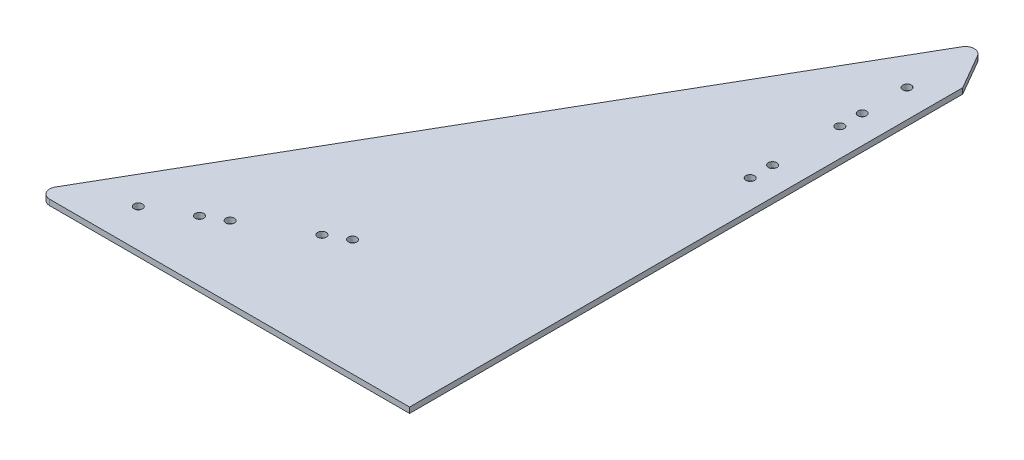
ISO-10303-21;
HEADER;
FILE_DESCRIPTION(('STEP AP214'),'2;1');
FILE_NAME('part.step','',(''),(''),'','','');
FILE_SCHEMA(('AUTOMOTIVE_DESIGN { 1 0 10303 214 1 1 1 1 }'));
ENDSEC;
DATA;
#1=APPLICATION_CONTEXT('core data for automotive mechanical design processes');
#2=APPLICATION_PROTOCOL_DEFINITION('international standard','automotive_design',2000,#1);
#3=PRODUCT_CONTEXT('',#1,'mechanical');
#4=PRODUCT('Part','Part','',(#3));
#5=PRODUCT_RELATED_PRODUCT_CATEGORY('part','',(#4));
#6=PRODUCT_DEFINITION_FORMATION('','',#4);
#7=PRODUCT_DEFINITION_CONTEXT('part definition',#1,'design');
#8=PRODUCT_DEFINITION('design','',#6,#7);
#9=PRODUCT_DEFINITION_SHAPE('','',#8);
#10=(LENGTH_UNIT() NAMED_UNIT(*) SI_UNIT(.MILLI.,.METRE.));
#11=(NAMED_UNIT(*) PLANE_ANGLE_UNIT() SI_UNIT($,.RADIAN.));
#12=(NAMED_UNIT(*) SI_UNIT($,.STERADIAN.) SOLID_ANGLE_UNIT());
#13=UNCERTAINTY_MEASURE_WITH_UNIT(LENGTH_MEASURE(1.E-05),#10,'distance_accuracy_value','');
#14=(GEOMETRIC_REPRESENTATION_CONTEXT(3) GLOBAL_UNCERTAINTY_ASSIGNED_CONTEXT((#13)) GLOBAL_UNIT_ASSIGNED_CONTEXT((#10,
#11,#12)) REPRESENTATION_CONTEXT('',''));
#15=CARTESIAN_POINT('',(0.,0.,0.));
#16=DIRECTION('',(0.,0.,1.));
#17=DIRECTION('',(1.,0.,0.));
#18=AXIS2_PLACEMENT_3D('',#15,#16,#17);
#19=CARTESIAN_POINT('',(196.85,3.175,-340.954201469933));
#20=DIRECTION('',(0.866025403784439,0.,0.5));
#21=DIRECTION('',(0.5,0.,-0.866025403784439));
#22=AXIS2_PLACEMENT_3D('',#19,#20,#21);
#23=PLANE('',#22);
#24=DIRECTION('',(-0.5,0.,0.866025403784439));
#25=VECTOR('',#24,1.);
#26=CARTESIAN_POINT('',(196.85,3.175,-340.954201469933));
#27=LINE('',#26,#25);
#28=CARTESIAN_POINT('',(192.450590948775,3.175,-333.334201469933));
#29=VERTEX_POINT('',#28);
#30=CARTESIAN_POINT('',(4.39940905122493,3.175,-7.61999999999996));
#31=VERTEX_POINT('',#30);
#32=EDGE_CURVE('E109',#29,#31,#27,.T.);
#33=ORIENTED_EDGE('',*,*,#32,.F.);
#34=DIRECTION('',(0.,-1.,0.));
#35=VECTOR('',#34,1.);
#36=CARTESIAN_POINT('',(192.450590948775,3.175,-333.334201469933));
#37=LINE('',#36,#35);
#38=CARTESIAN_POINT('',(192.450590948775,0.,-333.334201469933));
#39=VERTEX_POINT('',#38);
#40=EDGE_CURVE('E120',#29,#39,#37,.T.);
#41=ORIENTED_EDGE('',*,*,#40,.T.);
#42=DIRECTION('',(-0.5,0.,0.866025403784439));
#43=VECTOR('',#42,1.);
#44=CARTESIAN_POINT('',(196.85,0.,-340.954201469933));
#45=LINE('',#44,#43);
#46=CARTESIAN_POINT('',(4.39940905122493,0.,-7.61999999999996));
#47=VERTEX_POINT('',#46);
#48=EDGE_CURVE('E114',#39,#47,#45,.T.);
#49=ORIENTED_EDGE('',*,*,#48,.T.);
#50=DIRECTION('',(0.,-1.,0.));
#51=VECTOR('',#50,1.);
#52=CARTESIAN_POINT('',(4.39940905122499,3.175,-7.62000000000002));
#53=LINE('',#52,#51);
#54=EDGE_CURVE('E118',#47,#31,#53,.F.);
#55=ORIENTED_EDGE('',*,*,#54,.T.);
#56=EDGE_LOOP('',(#33,#41,#49,#55));
#57=FACE_BOUND('',#56,.T.);
#58=ADVANCED_FACE('F33',(#57),#23,.F.);
#59=CARTESIAN_POINT('',(0.,3.175,0.));
#60=DIRECTION('',(0.,0.,-1.));
#61=DIRECTION('',(-1.,0.,0.));
#62=AXIS2_PLACEMENT_3D('',#59,#60,#61);
#63=PLANE('',#62);
#64=DIRECTION('',(1.,0.,0.));
#65=VECTOR('',#64,1.);
#66=CARTESIAN_POINT('',(0.,0.,0.));
#67=LINE('',#66,#65);
#68=CARTESIAN_POINT('',(8.79881810244991,0.,0.));
#69=VERTEX_POINT('',#68);
#70=CARTESIAN_POINT('',(212.725,0.,0.));
#71=VERTEX_POINT('',#70);
#72=EDGE_CURVE('E110',#69,#71,#67,.T.);
#73=ORIENTED_EDGE('',*,*,#72,.T.);
#74=DIRECTION('',(0.,1.,0.));
#75=VECTOR('',#74,1.);
#76=CARTESIAN_POINT('',(212.725,-360.104992878323,0.));
#77=LINE('',#76,#75);
#78=CARTESIAN_POINT('',(212.725,3.175,0.));
#79=VERTEX_POINT('',#78);
#80=EDGE_CURVE('E48',#71,#79,#77,.T.);
#81=ORIENTED_EDGE('',*,*,#80,.T.);
#82=DIRECTION('',(1.,0.,0.));
#83=VECTOR('',#82,1.);
#84=CARTESIAN_POINT('',(0.,3.175,0.));
#85=LINE('',#84,#83);
#86=CARTESIAN_POINT('',(8.79881810244991,3.175,0.));
#87=VERTEX_POINT('',#86);
#88=EDGE_CURVE('E112',#87,#79,#85,.T.);
#89=ORIENTED_EDGE('',*,*,#88,.F.);
#90=DIRECTION('',(0.,-1.,0.));
#91=VECTOR('',#90,1.);
#92=CARTESIAN_POINT('',(8.79881810244991,3.175,0.));
#93=LINE('',#92,#91);
#94=EDGE_CURVE('E11',#87,#69,#93,.T.);
#95=ORIENTED_EDGE('',*,*,#94,.T.);
#96=EDGE_LOOP('',(#73,#81,#89,#95));
#97=FACE_BOUND('',#96,.T.);
#98=ADVANCED_FACE('F150',(#97),#63,.F.);
#99=CARTESIAN_POINT('',(393.7,3.175,0.));
#100=DIRECTION('',(-0.866025403784439,0.,0.5));
#101=DIRECTION('',(0.5,0.,0.866025403784439));
#102=AXIS2_PLACEMENT_3D('',#99,#100,#101);
#103=PLANE('',#102);
#104=DIRECTION('',(-0.5,0.,-0.866025403784439));
#105=VECTOR('',#104,1.);
#106=CARTESIAN_POINT('',(393.7,3.175,0.));
#107=LINE('',#106,#105);
#108=CARTESIAN_POINT('',(212.725,3.175,-313.457894899778));
#109=VERTEX_POINT('',#108);
#110=CARTESIAN_POINT('',(201.249409051225,3.175,-333.334201469934));
#111=VERTEX_POINT('',#110);
#112=EDGE_CURVE('E103',#109,#111,#107,.T.);
#113=ORIENTED_EDGE('',*,*,#112,.F.);
#114=DIRECTION('',(0.,1.,0.));
#115=VECTOR('',#114,1.);
#116=CARTESIAN_POINT('',(212.725,-360.104992878323,-313.457894899778));
#117=LINE('',#116,#115);
#118=CARTESIAN_POINT('',(212.725,0.,-313.457894899778));
#119=VERTEX_POINT('',#118);
#120=EDGE_CURVE('E88',#119,#109,#117,.T.);
#121=ORIENTED_EDGE('',*,*,#120,.F.);
#122=DIRECTION('',(-0.5,0.,-0.866025403784439));
#123=VECTOR('',#122,1.);
#124=CARTESIAN_POINT('',(393.7,0.,0.));
#125=LINE('',#124,#123);
#126=CARTESIAN_POINT('',(201.249409051225,0.,-333.334201469934));
#127=VERTEX_POINT('',#126);
#128=EDGE_CURVE('E101',#119,#127,#125,.T.);
#129=ORIENTED_EDGE('',*,*,#128,.T.);
#130=DIRECTION('',(0.,-1.,0.));
#131=VECTOR('',#130,1.);
#132=CARTESIAN_POINT('',(201.249409051225,3.175,-333.334201469933));
#133=LINE('',#132,#131);
#134=EDGE_CURVE('E126',#127,#111,#133,.F.);
#135=ORIENTED_EDGE('',*,*,#134,.T.);
#136=EDGE_LOOP('',(#113,#121,#129,#135));
#137=FACE_BOUND('',#136,.T.);
#138=ADVANCED_FACE('F99',(#137),#103,.F.);
#139=CARTESIAN_POINT('',(0.,3.175,0.));
#140=DIRECTION('',(0.,1.,0.));
#141=DIRECTION('',(0.,0.,1.));
#142=AXIS2_PLACEMENT_3D('',#139,#140,#141);
#143=PLANE('',#142);
#144=DIRECTION('',(0.,0.,1.));
#145=VECTOR('',#144,1.);
#146=CARTESIAN_POINT('',(212.725,3.175,0.));
#147=LINE('',#146,#145);
#148=EDGE_CURVE('E95',#109,#79,#147,.T.);
#149=ORIENTED_EDGE('',*,*,#148,.F.);
#150=ORIENTED_EDGE('',*,*,#112,.T.);
#151=CARTESIAN_POINT('',(196.85,3.175,-330.794201469934));
#152=DIRECTION('',(0.,1.,0.));
#153=DIRECTION('',(0.,0.,1.));
#154=AXIS2_PLACEMENT_3D('',#151,#152,#153);
#155=CIRCLE('',#154,5.08);
#156=EDGE_CURVE('E41',#111,#29,#155,.T.);
#157=ORIENTED_EDGE('',*,*,#156,.T.);
#158=ORIENTED_EDGE('',*,*,#32,.T.);
#159=CARTESIAN_POINT('',(8.79881810244991,3.175,-5.08));
#160=DIRECTION('',(0.,1.,0.));
#161=DIRECTION('',(0.,0.,1.));
#162=AXIS2_PLACEMENT_3D('',#159,#160,#161);
#163=CIRCLE('',#162,5.08);
#164=EDGE_CURVE('E56',#31,#87,#163,.T.);
#165=ORIENTED_EDGE('',*,*,#164,.T.);
#166=ORIENTED_EDGE('',*,*,#88,.T.);
#167=EDGE_LOOP('',(#149,#150,#157,#158,#165,#166));
#168=FACE_BOUND('',#167,.T.);
#169=CARTESIAN_POINT('',(37.3949769354121,3.175,-21.59));
#170=DIRECTION('',(0.,1.,0.));
#171=DIRECTION('',(0.,0.,1.));
#172=AXIS2_PLACEMENT_3D('',#169,#170,#171);
#173=CIRCLE('',#172,2.413);
#174=CARTESIAN_POINT('',(37.3949769354121,3.175,-19.177));
#175=VERTEX_POINT('',#174);
#176=EDGE_CURVE('E310',#175,#175,#173,.T.);
#177=ORIENTED_EDGE('',*,*,#176,.F.);
#178=EDGE_LOOP('',(#177));
#179=FACE_BOUND('',#178,.T.);
#180=CARTESIAN_POINT('',(196.85,3.175,-208.874201469934));
#181=DIRECTION('',(0.,1.,0.));
#182=DIRECTION('',(0.,0.,1.));
#183=AXIS2_PLACEMENT_3D('',#180,#181,#182);
#184=CIRCLE('',#183,2.413);
#185=CARTESIAN_POINT('',(196.85,3.175,-206.461201469934));
#186=VERTEX_POINT('',#185);
#187=EDGE_CURVE('E94',#186,#186,#184,.T.);
#188=ORIENTED_EDGE('',*,*,#187,.F.);
#189=EDGE_LOOP('',(#188));
#190=FACE_BOUND('',#189,.T.);
#191=CARTESIAN_POINT('',(196.85,3.175,-221.574201469934));
#192=DIRECTION('',(0.,1.,0.));
#193=DIRECTION('',(0.,0.,1.));
#194=AXIS2_PLACEMENT_3D('',#191,#192,#193);
#195=CIRCLE('',#194,2.413);
#196=CARTESIAN_POINT('',(196.85,3.175,-219.161201469934));
#197=VERTEX_POINT('',#196);
#198=EDGE_CURVE('E324',#197,#197,#195,.T.);
#199=ORIENTED_EDGE('',*,*,#198,.F.);
#200=EDGE_LOOP('',(#199));
#201=FACE_BOUND('',#200,.T.);
#202=CARTESIAN_POINT('',(196.85,3.175,-259.674201469934));
#203=DIRECTION('',(0.,1.,0.));
#204=DIRECTION('',(0.,0.,1.));
#205=AXIS2_PLACEMENT_3D('',#202,#203,#204);
#206=CIRCLE('',#205,2.413);
#207=CARTESIAN_POINT('',(196.85,3.175,-257.261201469934));
#208=VERTEX_POINT('',#207);
#209=EDGE_CURVE('E358',#208,#208,#206,.T.);
#210=ORIENTED_EDGE('',*,*,#209,.F.);
#211=EDGE_LOOP('',(#210));
#212=FACE_BOUND('',#211,.T.);
#213=CARTESIAN_POINT('',(196.85,3.175,-272.374201469934));
#214=DIRECTION('',(0.,1.,0.));
#215=DIRECTION('',(0.,0.,1.));
#216=AXIS2_PLACEMENT_3D('',#213,#214,#215);
#217=CIRCLE('',#216,2.413);
#218=CARTESIAN_POINT('',(196.85,3.175,-269.961201469934));
#219=VERTEX_POINT('',#218);
#220=EDGE_CURVE('E352',#219,#219,#217,.T.);
#221=ORIENTED_EDGE('',*,*,#220,.F.);
#222=EDGE_LOOP('',(#221));
#223=FACE_BOUND('',#222,.T.);
#224=CARTESIAN_POINT('',(196.85,3.175,-297.774201469934));
#225=DIRECTION('',(0.,1.,0.));
#226=DIRECTION('',(0.,0.,1.));
#227=AXIS2_PLACEMENT_3D('',#224,#225,#226);
#228=CIRCLE('',#227,2.413);
#229=CARTESIAN_POINT('',(196.85,3.175,-295.361201469934));
#230=VERTEX_POINT('',#229);
#231=EDGE_CURVE('E346',#230,#230,#228,.T.);
#232=ORIENTED_EDGE('',*,*,#231,.F.);
#233=EDGE_LOOP('',(#232));
#234=FACE_BOUND('',#233,.T.);
#235=CARTESIAN_POINT('',(103.386112703786,3.175,-59.69));
#236=DIRECTION('',(0.,1.,0.));
#237=DIRECTION('',(0.,0.,1.));
#238=AXIS2_PLACEMENT_3D('',#235,#236,#237);
#239=CIRCLE('',#238,2.41299999999999);
#240=CARTESIAN_POINT('',(103.386112703786,3.175,-57.277));
#241=VERTEX_POINT('',#240);
#242=EDGE_CURVE('E340',#241,#241,#239,.T.);
#243=ORIENTED_EDGE('',*,*,#242,.F.);
#244=EDGE_LOOP('',(#243));
#245=FACE_BOUND('',#244,.T.);
#246=CARTESIAN_POINT('',(114.384635331849,3.175,-66.04));
#247=DIRECTION('',(0.,1.,0.));
#248=DIRECTION('',(0.,0.,1.));
#249=AXIS2_PLACEMENT_3D('',#246,#247,#248);
#250=CIRCLE('',#249,2.41299999999999);
#251=CARTESIAN_POINT('',(114.384635331849,3.175,-63.627));
#252=VERTEX_POINT('',#251);
#253=EDGE_CURVE('E334',#252,#252,#250,.T.);
#254=ORIENTED_EDGE('',*,*,#253,.F.);
#255=EDGE_LOOP('',(#254));
#256=FACE_BOUND('',#255,.T.);
#257=CARTESIAN_POINT('',(70.3905448195992,3.175,-40.64));
#258=DIRECTION('',(0.,1.,0.));
#259=DIRECTION('',(0.,0.,1.));
#260=AXIS2_PLACEMENT_3D('',#257,#258,#259);
#261=CIRCLE('',#260,2.41299999999999);
#262=CARTESIAN_POINT('',(70.3905448195992,3.175,-38.227));
#263=VERTEX_POINT('',#262);
#264=EDGE_CURVE('E328',#263,#263,#261,.T.);
#265=ORIENTED_EDGE('',*,*,#264,.F.);
#266=EDGE_LOOP('',(#265));
#267=FACE_BOUND('',#266,.T.);
#268=CARTESIAN_POINT('',(59.3920221915368,3.175,-34.29));
#269=DIRECTION('',(0.,1.,0.));
#270=DIRECTION('',(0.,0.,1.));
#271=AXIS2_PLACEMENT_3D('',#268,#269,#270);
#272=CIRCLE('',#271,2.41299999999999);
#273=CARTESIAN_POINT('',(59.3920221915368,3.175,-31.877));
#274=VERTEX_POINT('',#273);
#275=EDGE_CURVE('E315',#274,#274,#272,.T.);
#276=ORIENTED_EDGE('',*,*,#275,.F.);
#277=EDGE_LOOP('',(#276));
#278=FACE_BOUND('',#277,.T.);
#279=ADVANCED_FACE('F130',(#168,#179,#190,#201,#212,#223,#234,#245,#256,#267,#278),#143,.T.);
#280=CARTESIAN_POINT('',(0.,0.,0.));
#281=DIRECTION('',(0.,1.,0.));
#282=DIRECTION('',(0.,0.,1.));
#283=AXIS2_PLACEMENT_3D('',#280,#281,#282);
#284=PLANE('',#283);
#285=CARTESIAN_POINT('',(37.3949769354121,0.,-21.59));
#286=DIRECTION('',(0.,1.,0.));
#287=DIRECTION('',(0.,0.,1.));
#288=AXIS2_PLACEMENT_3D('',#285,#286,#287);
#289=CIRCLE('',#288,2.413);
#290=CARTESIAN_POINT('',(37.3949769354121,0.,-19.177));
#291=VERTEX_POINT('',#290);
#292=EDGE_CURVE('E307',#291,#291,#289,.F.);
#293=ORIENTED_EDGE('',*,*,#292,.F.);
#294=EDGE_LOOP('',(#293));
#295=FACE_BOUND('',#294,.T.);
#296=CARTESIAN_POINT('',(196.85,0.,-208.874201469934));
#297=DIRECTION('',(0.,1.,0.));
#298=DIRECTION('',(0.,0.,1.));
#299=AXIS2_PLACEMENT_3D('',#296,#297,#298);
#300=CIRCLE('',#299,2.413);
#301=CARTESIAN_POINT('',(196.85,0.,-206.461201469934));
#302=VERTEX_POINT('',#301);
#303=EDGE_CURVE('E321',#302,#302,#300,.F.);
#304=ORIENTED_EDGE('',*,*,#303,.F.);
#305=EDGE_LOOP('',(#304));
#306=FACE_BOUND('',#305,.T.);
#307=CARTESIAN_POINT('',(196.85,0.,-221.574201469934));
#308=DIRECTION('',(0.,1.,0.));
#309=DIRECTION('',(0.,0.,1.));
#310=AXIS2_PLACEMENT_3D('',#307,#308,#309);
#311=CIRCLE('',#310,2.413);
#312=CARTESIAN_POINT('',(196.85,0.,-219.161201469934));
#313=VERTEX_POINT('',#312);
#314=EDGE_CURVE('E361',#313,#313,#311,.F.);
#315=ORIENTED_EDGE('',*,*,#314,.F.);
#316=EDGE_LOOP('',(#315));
#317=FACE_BOUND('',#316,.T.);
#318=CARTESIAN_POINT('',(196.85,0.,-259.674201469934));
#319=DIRECTION('',(0.,1.,0.));
#320=DIRECTION('',(0.,0.,1.));
#321=AXIS2_PLACEMENT_3D('',#318,#319,#320);
#322=CIRCLE('',#321,2.413);
#323=CARTESIAN_POINT('',(196.85,0.,-257.261201469934));
#324=VERTEX_POINT('',#323);
#325=EDGE_CURVE('E355',#324,#324,#322,.F.);
#326=ORIENTED_EDGE('',*,*,#325,.F.);
#327=EDGE_LOOP('',(#326));
#328=FACE_BOUND('',#327,.T.);
#329=CARTESIAN_POINT('',(196.85,0.,-272.374201469934));
#330=DIRECTION('',(0.,1.,0.));
#331=DIRECTION('',(0.,0.,1.));
#332=AXIS2_PLACEMENT_3D('',#329,#330,#331);
#333=CIRCLE('',#332,2.413);
#334=CARTESIAN_POINT('',(196.85,0.,-269.961201469934));
#335=VERTEX_POINT('',#334);
#336=EDGE_CURVE('E349',#335,#335,#333,.F.);
#337=ORIENTED_EDGE('',*,*,#336,.F.);
#338=EDGE_LOOP('',(#337));
#339=FACE_BOUND('',#338,.T.);
#340=CARTESIAN_POINT('',(196.85,0.,-297.774201469934));
#341=DIRECTION('',(0.,1.,0.));
#342=DIRECTION('',(0.,0.,1.));
#343=AXIS2_PLACEMENT_3D('',#340,#341,#342);
#344=CIRCLE('',#343,2.413);
#345=CARTESIAN_POINT('',(196.85,0.,-295.361201469934));
#346=VERTEX_POINT('',#345);
#347=EDGE_CURVE('E343',#346,#346,#344,.F.);
#348=ORIENTED_EDGE('',*,*,#347,.F.);
#349=EDGE_LOOP('',(#348));
#350=FACE_BOUND('',#349,.T.);
#351=CARTESIAN_POINT('',(103.386112703786,0.,-59.69));
#352=DIRECTION('',(0.,1.,0.));
#353=DIRECTION('',(0.,0.,1.));
#354=AXIS2_PLACEMENT_3D('',#351,#352,#353);
#355=CIRCLE('',#354,2.41299999999999);
#356=CARTESIAN_POINT('',(103.386112703786,0.,-57.277));
#357=VERTEX_POINT('',#356);
#358=EDGE_CURVE('E337',#357,#357,#355,.F.);
#359=ORIENTED_EDGE('',*,*,#358,.F.);
#360=EDGE_LOOP('',(#359));
#361=FACE_BOUND('',#360,.T.);
#362=CARTESIAN_POINT('',(114.384635331849,0.,-66.04));
#363=DIRECTION('',(0.,1.,0.));
#364=DIRECTION('',(0.,0.,1.));
#365=AXIS2_PLACEMENT_3D('',#362,#363,#364);
#366=CIRCLE('',#365,2.41299999999999);
#367=CARTESIAN_POINT('',(114.384635331849,0.,-63.627));
#368=VERTEX_POINT('',#367);
#369=EDGE_CURVE('E331',#368,#368,#366,.F.);
#370=ORIENTED_EDGE('',*,*,#369,.F.);
#371=EDGE_LOOP('',(#370));
#372=FACE_BOUND('',#371,.T.);
#373=CARTESIAN_POINT('',(70.3905448195992,0.,-40.64));
#374=DIRECTION('',(0.,1.,0.));
#375=DIRECTION('',(0.,0.,1.));
#376=AXIS2_PLACEMENT_3D('',#373,#374,#375);
#377=CIRCLE('',#376,2.41299999999999);
#378=CARTESIAN_POINT('',(70.3905448195992,0.,-38.227));
#379=VERTEX_POINT('',#378);
#380=EDGE_CURVE('E326',#379,#379,#377,.F.);
#381=ORIENTED_EDGE('',*,*,#380,.F.);
#382=EDGE_LOOP('',(#381));
#383=FACE_BOUND('',#382,.T.);
#384=CARTESIAN_POINT('',(59.3920221915368,0.,-34.29));
#385=DIRECTION('',(0.,1.,0.));
#386=DIRECTION('',(0.,0.,1.));
#387=AXIS2_PLACEMENT_3D('',#384,#385,#386);
#388=CIRCLE('',#387,2.41299999999999);
#389=CARTESIAN_POINT('',(59.3920221915368,0.,-31.877));
#390=VERTEX_POINT('',#389);
#391=EDGE_CURVE('E311',#390,#390,#388,.F.);
#392=ORIENTED_EDGE('',*,*,#391,.F.);
#393=EDGE_LOOP('',(#392));
#394=FACE_BOUND('',#393,.T.);
#395=ORIENTED_EDGE('',*,*,#128,.F.);
#396=DIRECTION('',(0.,0.,-1.));
#397=VECTOR('',#396,1.);
#398=CARTESIAN_POINT('',(212.725,0.,0.));
#399=LINE('',#398,#397);
#400=EDGE_CURVE('E85',#71,#119,#399,.T.);
#401=ORIENTED_EDGE('',*,*,#400,.F.);
#402=ORIENTED_EDGE('',*,*,#72,.F.);
#403=CARTESIAN_POINT('',(8.79881810244991,0.,-5.08));
#404=DIRECTION('',(0.,1.,0.));
#405=DIRECTION('',(0.,0.,1.));
#406=AXIS2_PLACEMENT_3D('',#403,#404,#405);
#407=CIRCLE('',#406,5.08);
#408=EDGE_CURVE('E123',#69,#47,#407,.F.);
#409=ORIENTED_EDGE('',*,*,#408,.T.);
#410=ORIENTED_EDGE('',*,*,#48,.F.);
#411=CARTESIAN_POINT('',(196.85,0.,-330.794201469934));
#412=DIRECTION('',(0.,1.,0.));
#413=DIRECTION('',(0.,0.,1.));
#414=AXIS2_PLACEMENT_3D('',#411,#412,#413);
#415=CIRCLE('',#414,5.08);
#416=EDGE_CURVE('E107',#39,#127,#415,.F.);
#417=ORIENTED_EDGE('',*,*,#416,.T.);
#418=EDGE_LOOP('',(#395,#401,#402,#409,#410,#417));
#419=FACE_BOUND('',#418,.T.);
#420=ADVANCED_FACE('F105',(#295,#306,#317,#328,#339,#350,#361,#372,#383,#394,#419),#284,.F.);
#421=CARTESIAN_POINT('',(196.85,3.175,-330.794201469934));
#422=DIRECTION('',(0.,-1.,0.));
#423=DIRECTION('',(0.,0.,-1.));
#424=AXIS2_PLACEMENT_3D('',#421,#422,#423);
#425=CYLINDRICAL_SURFACE('',#424,5.08);
#426=ORIENTED_EDGE('',*,*,#156,.F.);
#427=ORIENTED_EDGE('',*,*,#134,.F.);
#428=ORIENTED_EDGE('',*,*,#416,.F.);
#429=ORIENTED_EDGE('',*,*,#40,.F.);
#430=EDGE_LOOP('',(#426,#427,#428,#429));
#431=FACE_BOUND('',#430,.T.);
#432=ADVANCED_FACE('F137',(#431),#425,.T.);
#433=CARTESIAN_POINT('',(8.79881810244991,3.175,-5.08));
#434=DIRECTION('',(0.,-1.,0.));
#435=DIRECTION('',(0.,0.,-1.));
#436=AXIS2_PLACEMENT_3D('',#433,#434,#435);
#437=CYLINDRICAL_SURFACE('',#436,5.08);
#438=ORIENTED_EDGE('',*,*,#164,.F.);
#439=ORIENTED_EDGE('',*,*,#54,.F.);
#440=ORIENTED_EDGE('',*,*,#408,.F.);
#441=ORIENTED_EDGE('',*,*,#94,.F.);
#442=EDGE_LOOP('',(#438,#439,#440,#441));
#443=FACE_BOUND('',#442,.T.);
#444=ADVANCED_FACE('F35',(#443),#437,.T.);
#445=CARTESIAN_POINT('',(59.3920221915368,-6.82499465201255,-34.29));
#446=DIRECTION('',(0.,1.,0.));
#447=DIRECTION('',(0.,0.,1.));
#448=AXIS2_PLACEMENT_3D('',#445,#446,#447);
#449=CYLINDRICAL_SURFACE('',#448,2.41299999999999);
#450=ORIENTED_EDGE('',*,*,#391,.T.);
#451=EDGE_LOOP('',(#450));
#452=FACE_BOUND('',#451,.T.);
#453=ORIENTED_EDGE('',*,*,#275,.T.);
#454=EDGE_LOOP('',(#453));
#455=FACE_BOUND('',#454,.T.);
#456=ADVANCED_FACE('F143',(#452,#455),#449,.F.);
#457=CARTESIAN_POINT('',(70.3905448195992,-6.82499465201255,-40.64));
#458=DIRECTION('',(0.,1.,0.));
#459=DIRECTION('',(0.,0.,1.));
#460=AXIS2_PLACEMENT_3D('',#457,#458,#459);
#461=CYLINDRICAL_SURFACE('',#460,2.41299999999999);
#462=ORIENTED_EDGE('',*,*,#380,.T.);
#463=EDGE_LOOP('',(#462));
#464=FACE_BOUND('',#463,.T.);
#465=ORIENTED_EDGE('',*,*,#264,.T.);
#466=EDGE_LOOP('',(#465));
#467=FACE_BOUND('',#466,.T.);
#468=ADVANCED_FACE('F186',(#464,#467),#461,.F.);
#469=CARTESIAN_POINT('',(114.384635331849,-6.82499465201255,-66.04));
#470=DIRECTION('',(0.,1.,0.));
#471=DIRECTION('',(0.,0.,1.));
#472=AXIS2_PLACEMENT_3D('',#469,#470,#471);
#473=CYLINDRICAL_SURFACE('',#472,2.41299999999999);
#474=ORIENTED_EDGE('',*,*,#369,.T.);
#475=EDGE_LOOP('',(#474));
#476=FACE_BOUND('',#475,.T.);
#477=ORIENTED_EDGE('',*,*,#253,.T.);
#478=EDGE_LOOP('',(#477));
#479=FACE_BOUND('',#478,.T.);
#480=ADVANCED_FACE('F182',(#476,#479),#473,.F.);
#481=CARTESIAN_POINT('',(103.386112703786,-6.82499465201255,-59.69));
#482=DIRECTION('',(0.,1.,0.));
#483=DIRECTION('',(0.,0.,1.));
#484=AXIS2_PLACEMENT_3D('',#481,#482,#483);
#485=CYLINDRICAL_SURFACE('',#484,2.41299999999999);
#486=ORIENTED_EDGE('',*,*,#358,.T.);
#487=EDGE_LOOP('',(#486));
#488=FACE_BOUND('',#487,.T.);
#489=ORIENTED_EDGE('',*,*,#242,.T.);
#490=EDGE_LOOP('',(#489));
#491=FACE_BOUND('',#490,.T.);
#492=ADVANCED_FACE('F178',(#488,#491),#485,.F.);
#493=CARTESIAN_POINT('',(196.85,-6.82499465201255,-297.774201469934));
#494=DIRECTION('',(0.,1.,0.));
#495=DIRECTION('',(0.,0.,1.));
#496=AXIS2_PLACEMENT_3D('',#493,#494,#495);
#497=CYLINDRICAL_SURFACE('',#496,2.413);
#498=ORIENTED_EDGE('',*,*,#347,.T.);
#499=EDGE_LOOP('',(#498));
#500=FACE_BOUND('',#499,.T.);
#501=ORIENTED_EDGE('',*,*,#231,.T.);
#502=EDGE_LOOP('',(#501));
#503=FACE_BOUND('',#502,.T.);
#504=ADVANCED_FACE('F174',(#500,#503),#497,.F.);
#505=CARTESIAN_POINT('',(196.85,-6.82499465201255,-272.374201469934));
#506=DIRECTION('',(0.,1.,0.));
#507=DIRECTION('',(0.,0.,1.));
#508=AXIS2_PLACEMENT_3D('',#505,#506,#507);
#509=CYLINDRICAL_SURFACE('',#508,2.413);
#510=ORIENTED_EDGE('',*,*,#336,.T.);
#511=EDGE_LOOP('',(#510));
#512=FACE_BOUND('',#511,.T.);
#513=ORIENTED_EDGE('',*,*,#220,.T.);
#514=EDGE_LOOP('',(#513));
#515=FACE_BOUND('',#514,.T.);
#516=ADVANCED_FACE('F170',(#512,#515),#509,.F.);
#517=CARTESIAN_POINT('',(196.85,-6.82499465201255,-259.674201469934));
#518=DIRECTION('',(0.,1.,0.));
#519=DIRECTION('',(0.,0.,1.));
#520=AXIS2_PLACEMENT_3D('',#517,#518,#519);
#521=CYLINDRICAL_SURFACE('',#520,2.413);
#522=ORIENTED_EDGE('',*,*,#325,.T.);
#523=EDGE_LOOP('',(#522));
#524=FACE_BOUND('',#523,.T.);
#525=ORIENTED_EDGE('',*,*,#209,.T.);
#526=EDGE_LOOP('',(#525));
#527=FACE_BOUND('',#526,.T.);
#528=ADVANCED_FACE('F166',(#524,#527),#521,.F.);
#529=CARTESIAN_POINT('',(196.85,-6.82499465201255,-221.574201469934));
#530=DIRECTION('',(0.,1.,0.));
#531=DIRECTION('',(0.,0.,1.));
#532=AXIS2_PLACEMENT_3D('',#529,#530,#531);
#533=CYLINDRICAL_SURFACE('',#532,2.413);
#534=ORIENTED_EDGE('',*,*,#314,.T.);
#535=EDGE_LOOP('',(#534));
#536=FACE_BOUND('',#535,.T.);
#537=ORIENTED_EDGE('',*,*,#198,.T.);
#538=EDGE_LOOP('',(#537));
#539=FACE_BOUND('',#538,.T.);
#540=ADVANCED_FACE('F162',(#536,#539),#533,.F.);
#541=CARTESIAN_POINT('',(196.85,-6.82499465201255,-208.874201469934));
#542=DIRECTION('',(0.,1.,0.));
#543=DIRECTION('',(0.,0.,1.));
#544=AXIS2_PLACEMENT_3D('',#541,#542,#543);
#545=CYLINDRICAL_SURFACE('',#544,2.413);
#546=ORIENTED_EDGE('',*,*,#303,.T.);
#547=EDGE_LOOP('',(#546));
#548=FACE_BOUND('',#547,.T.);
#549=ORIENTED_EDGE('',*,*,#187,.T.);
#550=EDGE_LOOP('',(#549));
#551=FACE_BOUND('',#550,.T.);
#552=ADVANCED_FACE('F165',(#548,#551),#545,.F.);
#553=CARTESIAN_POINT('',(37.3949769354121,-6.82499465201255,-21.59));
#554=DIRECTION('',(0.,1.,0.));
#555=DIRECTION('',(0.,0.,1.));
#556=AXIS2_PLACEMENT_3D('',#553,#554,#555);
#557=CYLINDRICAL_SURFACE('',#556,2.413);
#558=ORIENTED_EDGE('',*,*,#292,.T.);
#559=EDGE_LOOP('',(#558));
#560=FACE_BOUND('',#559,.T.);
#561=ORIENTED_EDGE('',*,*,#176,.T.);
#562=EDGE_LOOP('',(#561));
#563=FACE_BOUND('',#562,.T.);
#564=ADVANCED_FACE('F196',(#560,#563),#557,.F.);
#565=CARTESIAN_POINT('',(212.725,-360.104992878323,0.));
#566=DIRECTION('',(-1.,0.,0.));
#567=DIRECTION('',(0.,0.,1.));
#568=AXIS2_PLACEMENT_3D('',#565,#566,#567);
#569=PLANE('',#568);
#570=ORIENTED_EDGE('',*,*,#400,.T.);
#571=ORIENTED_EDGE('',*,*,#120,.T.);
#572=ORIENTED_EDGE('',*,*,#148,.T.);
#573=ORIENTED_EDGE('',*,*,#80,.F.);
#574=EDGE_LOOP('',(#570,#571,#572,#573));
#575=FACE_BOUND('',#574,.T.);
#576=ADVANCED_FACE('F87',(#575),#569,.F.);
#577=CLOSED_SHELL('',(#58,#98,#138,#279,#420,#432,#444,#456,#468,#480,#492,#504,#516,#528,#540,
#552,#564,#576));
#578=MANIFOLD_SOLID_BREP('B2',#577);
#579=ADVANCED_BREP_SHAPE_REPRESENTATION('',(#18,#578),#14);
#580=SHAPE_DEFINITION_REPRESENTATION(#9,#579);
ENDSEC;
END-ISO-10303-21;
